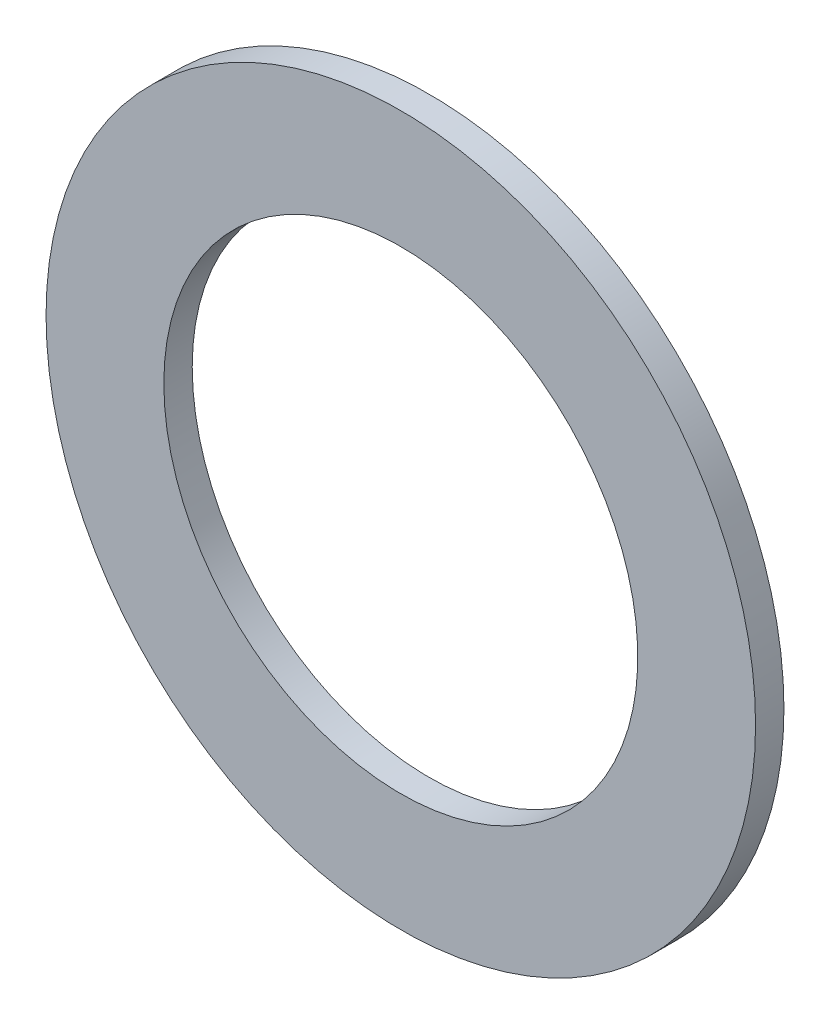
ISO-10303-21;
HEADER;
FILE_DESCRIPTION(('STEP AP214'),'2;1');
FILE_NAME('part.step','',(''),(''),'','','');
FILE_SCHEMA(('AUTOMOTIVE_DESIGN { 1 0 10303 214 1 1 1 1 }'));
ENDSEC;
DATA;
#1=APPLICATION_CONTEXT('core data for automotive mechanical design processes');
#2=APPLICATION_PROTOCOL_DEFINITION('international standard','automotive_design',2000,#1);
#3=PRODUCT_CONTEXT('',#1,'mechanical');
#4=PRODUCT('Part','Part','',(#3));
#5=PRODUCT_RELATED_PRODUCT_CATEGORY('part','',(#4));
#6=PRODUCT_DEFINITION_FORMATION('','',#4);
#7=PRODUCT_DEFINITION_CONTEXT('part definition',#1,'design');
#8=PRODUCT_DEFINITION('design','',#6,#7);
#9=PRODUCT_DEFINITION_SHAPE('','',#8);
#10=(LENGTH_UNIT() NAMED_UNIT(*) SI_UNIT(.MILLI.,.METRE.));
#11=(NAMED_UNIT(*) PLANE_ANGLE_UNIT() SI_UNIT($,.RADIAN.));
#12=(NAMED_UNIT(*) SI_UNIT($,.STERADIAN.) SOLID_ANGLE_UNIT());
#13=UNCERTAINTY_MEASURE_WITH_UNIT(LENGTH_MEASURE(1.E-05),#10,'distance_accuracy_value','');
#14=(GEOMETRIC_REPRESENTATION_CONTEXT(3) GLOBAL_UNCERTAINTY_ASSIGNED_CONTEXT((#13)) GLOBAL_UNIT_ASSIGNED_CONTEXT((#10,
#11,#12)) REPRESENTATION_CONTEXT('',''));
#15=CARTESIAN_POINT('',(0.,0.,0.));
#16=DIRECTION('',(0.,0.,1.));
#17=DIRECTION('',(1.,0.,0.));
#18=AXIS2_PLACEMENT_3D('',#15,#16,#17);
#19=CARTESIAN_POINT('',(0.,0.,-0.381));
#20=DIRECTION('',(0.,0.,1.));
#21=DIRECTION('',(1.,0.,0.));
#22=AXIS2_PLACEMENT_3D('',#19,#20,#21);
#23=PLANE('',#22);
#24=CARTESIAN_POINT('',(0.,0.,-0.381));
#25=DIRECTION('',(0.,0.,-1.));
#26=DIRECTION('',(-1.,0.,0.));
#27=AXIS2_PLACEMENT_3D('',#24,#25,#26);
#28=CIRCLE('',#27,6.3627);
#29=CARTESIAN_POINT('',(-6.3627,0.,-0.381));
#30=VERTEX_POINT('',#29);
#31=EDGE_CURVE('E28',#30,#30,#28,.F.);
#32=ORIENTED_EDGE('',*,*,#31,.T.);
#33=EDGE_LOOP('',(#32));
#34=FACE_BOUND('',#33,.T.);
#35=CARTESIAN_POINT('',(0.,0.,-0.381));
#36=DIRECTION('',(0.,0.,-1.));
#37=DIRECTION('',(-1.,0.,0.));
#38=AXIS2_PLACEMENT_3D('',#35,#36,#37);
#39=CIRCLE('',#38,9.525);
#40=CARTESIAN_POINT('',(-9.525,0.,-0.381));
#41=VERTEX_POINT('',#40);
#42=EDGE_CURVE('E19',#41,#41,#39,.F.);
#43=ORIENTED_EDGE('',*,*,#42,.F.);
#44=EDGE_LOOP('',(#43));
#45=FACE_BOUND('',#44,.T.);
#46=ADVANCED_FACE('F16',(#34,#45),#23,.F.);
#47=CARTESIAN_POINT('',(0.,0.,0.381));
#48=DIRECTION('',(0.,0.,-1.));
#49=DIRECTION('',(-1.,0.,0.));
#50=AXIS2_PLACEMENT_3D('',#47,#48,#49);
#51=CYLINDRICAL_SURFACE('',#50,9.525);
#52=ORIENTED_EDGE('',*,*,#42,.T.);
#53=EDGE_LOOP('',(#52));
#54=FACE_BOUND('',#53,.T.);
#55=CARTESIAN_POINT('',(0.,0.,0.381));
#56=DIRECTION('',(0.,0.,-1.));
#57=DIRECTION('',(-1.,0.,0.));
#58=AXIS2_PLACEMENT_3D('',#55,#56,#57);
#59=CIRCLE('',#58,9.525);
#60=CARTESIAN_POINT('',(-9.525,0.,0.381));
#61=VERTEX_POINT('',#60);
#62=EDGE_CURVE('E23',#61,#61,#59,.F.);
#63=ORIENTED_EDGE('',*,*,#62,.F.);
#64=EDGE_LOOP('',(#63));
#65=FACE_BOUND('',#64,.T.);
#66=ADVANCED_FACE('F36',(#54,#65),#51,.T.);
#67=CARTESIAN_POINT('',(0.,0.,0.381));
#68=DIRECTION('',(0.,0.,-1.));
#69=DIRECTION('',(-1.,0.,0.));
#70=AXIS2_PLACEMENT_3D('',#67,#68,#69);
#71=CYLINDRICAL_SURFACE('',#70,6.3627);
#72=CARTESIAN_POINT('',(0.,0.,0.381));
#73=DIRECTION('',(0.,0.,-1.));
#74=DIRECTION('',(-1.,0.,0.));
#75=AXIS2_PLACEMENT_3D('',#72,#73,#74);
#76=CIRCLE('',#75,6.3627);
#77=CARTESIAN_POINT('',(-6.3627,0.,0.381));
#78=VERTEX_POINT('',#77);
#79=EDGE_CURVE('E10',#78,#78,#76,.T.);
#80=ORIENTED_EDGE('',*,*,#79,.F.);
#81=EDGE_LOOP('',(#80));
#82=FACE_BOUND('',#81,.T.);
#83=ORIENTED_EDGE('',*,*,#31,.F.);
#84=EDGE_LOOP('',(#83));
#85=FACE_BOUND('',#84,.T.);
#86=ADVANCED_FACE('F43',(#82,#85),#71,.F.);
#87=CARTESIAN_POINT('',(0.,0.,0.381));
#88=DIRECTION('',(0.,0.,1.));
#89=DIRECTION('',(1.,0.,0.));
#90=AXIS2_PLACEMENT_3D('',#87,#88,#89);
#91=PLANE('',#90);
#92=ORIENTED_EDGE('',*,*,#79,.T.);
#93=EDGE_LOOP('',(#92));
#94=FACE_BOUND('',#93,.T.);
#95=ORIENTED_EDGE('',*,*,#62,.T.);
#96=EDGE_LOOP('',(#95));
#97=FACE_BOUND('',#96,.T.);
#98=ADVANCED_FACE('F44',(#94,#97),#91,.T.);
#99=CLOSED_SHELL('',(#46,#66,#86,#98));
#100=MANIFOLD_SOLID_BREP('B1',#99);
#101=ADVANCED_BREP_SHAPE_REPRESENTATION('',(#18,#100),#14);
#102=SHAPE_DEFINITION_REPRESENTATION(#9,#101);
ENDSEC;
END-ISO-10303-21;
